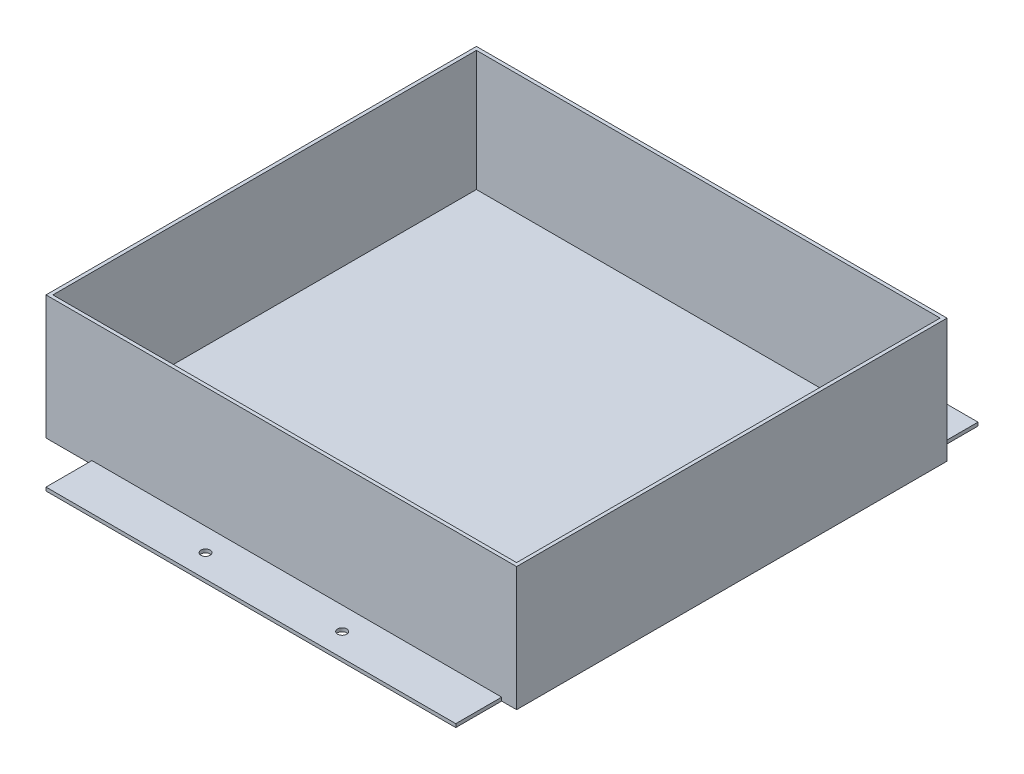
ISO-10303-21;
HEADER;
FILE_DESCRIPTION(('STEP AP214'),'2;1');
FILE_NAME('part.step','',(''),(''),'','','');
FILE_SCHEMA(('AUTOMOTIVE_DESIGN { 1 0 10303 214 1 1 1 1 }'));
ENDSEC;
DATA;
#1=APPLICATION_CONTEXT('core data for automotive mechanical design processes');
#2=APPLICATION_PROTOCOL_DEFINITION('international standard','automotive_design',2000,#1);
#3=PRODUCT_CONTEXT('',#1,'mechanical');
#4=PRODUCT('Part','Part','',(#3));
#5=PRODUCT_RELATED_PRODUCT_CATEGORY('part','',(#4));
#6=PRODUCT_DEFINITION_FORMATION('','',#4);
#7=PRODUCT_DEFINITION_CONTEXT('part definition',#1,'design');
#8=PRODUCT_DEFINITION('design','',#6,#7);
#9=PRODUCT_DEFINITION_SHAPE('','',#8);
#10=(LENGTH_UNIT() NAMED_UNIT(*) SI_UNIT(.MILLI.,.METRE.));
#11=(NAMED_UNIT(*) PLANE_ANGLE_UNIT() SI_UNIT($,.RADIAN.));
#12=(NAMED_UNIT(*) SI_UNIT($,.STERADIAN.) SOLID_ANGLE_UNIT());
#13=UNCERTAINTY_MEASURE_WITH_UNIT(LENGTH_MEASURE(1.E-05),#10,'distance_accuracy_value','');
#14=(GEOMETRIC_REPRESENTATION_CONTEXT(3) GLOBAL_UNCERTAINTY_ASSIGNED_CONTEXT((#13)) GLOBAL_UNIT_ASSIGNED_CONTEXT((#10,
#11,#12)) REPRESENTATION_CONTEXT('',''));
#15=CARTESIAN_POINT('',(0.,0.,0.));
#16=DIRECTION('',(0.,0.,1.));
#17=DIRECTION('',(1.,0.,0.));
#18=AXIS2_PLACEMENT_3D('',#15,#16,#17);
#19=CARTESIAN_POINT('',(0.,3.,0.));
#20=DIRECTION('',(0.,1.,0.));
#21=DIRECTION('',(0.,0.,1.));
#22=AXIS2_PLACEMENT_3D('',#19,#20,#21);
#23=PLANE('',#22);
#24=DIRECTION('',(-1.,0.,0.));
#25=VECTOR('',#24,1.);
#26=CARTESIAN_POINT('',(410.,3.,0.));
#27=LINE('',#26,#25);
#28=CARTESIAN_POINT('',(397.,3.,0.));
#29=VERTEX_POINT('',#28);
#30=CARTESIAN_POINT('',(40.,3.,0.));
#31=VERTEX_POINT('',#30);
#32=EDGE_CURVE('E11',#29,#31,#27,.T.);
#33=ORIENTED_EDGE('',*,*,#32,.F.);
#34=DIRECTION('',(0.,0.,-1.));
#35=VECTOR('',#34,1.);
#36=CARTESIAN_POINT('',(397.,3.,-40.));
#37=LINE('',#36,#35);
#38=CARTESIAN_POINT('',(397.,3.,-40.));
#39=VERTEX_POINT('',#38);
#40=EDGE_CURVE('E133',#29,#39,#37,.T.);
#41=ORIENTED_EDGE('',*,*,#40,.T.);
#42=DIRECTION('',(-1.,0.,0.));
#43=VECTOR('',#42,1.);
#44=CARTESIAN_POINT('',(40.,3.,-40.));
#45=LINE('',#44,#43);
#46=CARTESIAN_POINT('',(40.,3.,-40.));
#47=VERTEX_POINT('',#46);
#48=EDGE_CURVE('E137',#39,#47,#45,.T.);
#49=ORIENTED_EDGE('',*,*,#48,.T.);
#50=DIRECTION('',(0.,0.,1.));
#51=VECTOR('',#50,1.);
#52=CARTESIAN_POINT('',(40.,3.,0.));
#53=LINE('',#52,#51);
#54=EDGE_CURVE('E66',#47,#31,#53,.T.);
#55=ORIENTED_EDGE('',*,*,#54,.T.);
#56=EDGE_LOOP('',(#33,#41,#49,#55));
#57=FACE_BOUND('',#56,.T.);
#58=CARTESIAN_POINT('',(278.,3.,-20.));
#59=DIRECTION('',(0.,1.,0.));
#60=DIRECTION('',(0.,0.,1.));
#61=AXIS2_PLACEMENT_3D('',#58,#59,#60);
#62=CIRCLE('',#61,3.99999999999999);
#63=CARTESIAN_POINT('',(278.,3.,-16.));
#64=VERTEX_POINT('',#63);
#65=EDGE_CURVE('E264',#64,#64,#62,.T.);
#66=ORIENTED_EDGE('',*,*,#65,.F.);
#67=EDGE_LOOP('',(#66));
#68=FACE_BOUND('',#67,.T.);
#69=CARTESIAN_POINT('',(159.,3.,-20.));
#70=DIRECTION('',(0.,1.,0.));
#71=DIRECTION('',(0.,0.,1.));
#72=AXIS2_PLACEMENT_3D('',#69,#70,#71);
#73=CIRCLE('',#72,3.99999999999999);
#74=CARTESIAN_POINT('',(159.,3.,-16.));
#75=VERTEX_POINT('',#74);
#76=EDGE_CURVE('E169',#75,#75,#73,.T.);
#77=ORIENTED_EDGE('',*,*,#76,.F.);
#78=EDGE_LOOP('',(#77));
#79=FACE_BOUND('',#78,.T.);
#80=ADVANCED_FACE('F39',(#57,#68,#79),#23,.T.);
#81=DIRECTION('',(1.,0.,0.));
#82=VECTOR('',#81,1.);
#83=CARTESIAN_POINT('',(0.,3.,375.));
#84=LINE('',#83,#82);
#85=CARTESIAN_POINT('',(39.9999999999999,3.,375.));
#86=VERTEX_POINT('',#85);
#87=CARTESIAN_POINT('',(397.,3.,375.));
#88=VERTEX_POINT('',#87);
#89=EDGE_CURVE('E49',#86,#88,#84,.T.);
#90=ORIENTED_EDGE('',*,*,#89,.F.);
#91=DIRECTION('',(0.,0.,1.));
#92=VECTOR('',#91,1.);
#93=CARTESIAN_POINT('',(39.9999999999999,3.,375.));
#94=LINE('',#93,#92);
#95=CARTESIAN_POINT('',(39.9999999999999,3.,415.));
#96=VERTEX_POINT('',#95);
#97=EDGE_CURVE('E200',#86,#96,#94,.T.);
#98=ORIENTED_EDGE('',*,*,#97,.T.);
#99=DIRECTION('',(1.,0.,0.));
#100=VECTOR('',#99,1.);
#101=CARTESIAN_POINT('',(39.9999999999999,3.,415.));
#102=LINE('',#101,#100);
#103=CARTESIAN_POINT('',(397.,3.,415.));
#104=VERTEX_POINT('',#103);
#105=EDGE_CURVE('E280',#96,#104,#102,.T.);
#106=ORIENTED_EDGE('',*,*,#105,.T.);
#107=DIRECTION('',(0.,0.,-1.));
#108=VECTOR('',#107,1.);
#109=CARTESIAN_POINT('',(397.,3.,415.));
#110=LINE('',#109,#108);
#111=EDGE_CURVE('E143',#104,#88,#110,.T.);
#112=ORIENTED_EDGE('',*,*,#111,.T.);
#113=EDGE_LOOP('',(#90,#98,#106,#112));
#114=FACE_BOUND('',#113,.T.);
#115=CARTESIAN_POINT('',(278.,3.,395.));
#116=DIRECTION('',(0.,1.,0.));
#117=DIRECTION('',(0.,0.,-1.));
#118=AXIS2_PLACEMENT_3D('',#115,#116,#117);
#119=CIRCLE('',#118,3.99999999999999);
#120=CARTESIAN_POINT('',(278.,3.,391.));
#121=VERTEX_POINT('',#120);
#122=EDGE_CURVE('E256',#121,#121,#119,.T.);
#123=ORIENTED_EDGE('',*,*,#122,.F.);
#124=EDGE_LOOP('',(#123));
#125=FACE_BOUND('',#124,.T.);
#126=CARTESIAN_POINT('',(159.,3.,395.));
#127=DIRECTION('',(0.,1.,0.));
#128=DIRECTION('',(0.,0.,-1.));
#129=AXIS2_PLACEMENT_3D('',#126,#127,#128);
#130=CIRCLE('',#129,3.99999999999999);
#131=CARTESIAN_POINT('',(159.,3.,391.));
#132=VERTEX_POINT('',#131);
#133=EDGE_CURVE('E246',#132,#132,#130,.T.);
#134=ORIENTED_EDGE('',*,*,#133,.F.);
#135=EDGE_LOOP('',(#134));
#136=FACE_BOUND('',#135,.T.);
#137=ADVANCED_FACE('F285',(#114,#125,#136),#23,.T.);
#138=CARTESIAN_POINT('',(0.,0.,0.));
#139=DIRECTION('',(0.,1.,0.));
#140=DIRECTION('',(0.,0.,1.));
#141=AXIS2_PLACEMENT_3D('',#138,#139,#140);
#142=PLANE('',#141);
#143=DIRECTION('',(-1.,0.,0.));
#144=VECTOR('',#143,1.);
#145=CARTESIAN_POINT('',(40.,0.,0.));
#146=LINE('',#145,#144);
#147=CARTESIAN_POINT('',(40.,0.,0.));
#148=VERTEX_POINT('',#147);
#149=CARTESIAN_POINT('',(0.,0.,0.));
#150=VERTEX_POINT('',#149);
#151=EDGE_CURVE('E164',#148,#150,#146,.T.);
#152=ORIENTED_EDGE('',*,*,#151,.F.);
#153=DIRECTION('',(0.,0.,1.));
#154=VECTOR('',#153,1.);
#155=CARTESIAN_POINT('',(40.,0.,0.));
#156=LINE('',#155,#154);
#157=CARTESIAN_POINT('',(40.,0.,-40.));
#158=VERTEX_POINT('',#157);
#159=EDGE_CURVE('E111',#158,#148,#156,.T.);
#160=ORIENTED_EDGE('',*,*,#159,.F.);
#161=DIRECTION('',(-1.,0.,0.));
#162=VECTOR('',#161,1.);
#163=CARTESIAN_POINT('',(40.,0.,-40.));
#164=LINE('',#163,#162);
#165=CARTESIAN_POINT('',(397.,0.,-40.));
#166=VERTEX_POINT('',#165);
#167=EDGE_CURVE('E195',#166,#158,#164,.T.);
#168=ORIENTED_EDGE('',*,*,#167,.F.);
#169=DIRECTION('',(0.,0.,-1.));
#170=VECTOR('',#169,1.);
#171=CARTESIAN_POINT('',(397.,0.,-40.));
#172=LINE('',#171,#170);
#173=CARTESIAN_POINT('',(397.,0.,0.));
#174=VERTEX_POINT('',#173);
#175=EDGE_CURVE('E149',#174,#166,#172,.T.);
#176=ORIENTED_EDGE('',*,*,#175,.F.);
#177=DIRECTION('',(-1.,0.,0.));
#178=VECTOR('',#177,1.);
#179=CARTESIAN_POINT('',(410.,0.,0.));
#180=LINE('',#179,#178);
#181=CARTESIAN_POINT('',(410.,0.,0.));
#182=VERTEX_POINT('',#181);
#183=EDGE_CURVE('E190',#182,#174,#180,.T.);
#184=ORIENTED_EDGE('',*,*,#183,.F.);
#185=DIRECTION('',(0.,0.,-1.));
#186=VECTOR('',#185,1.);
#187=CARTESIAN_POINT('',(410.,0.,375.));
#188=LINE('',#187,#186);
#189=CARTESIAN_POINT('',(410.,0.,375.));
#190=VERTEX_POINT('',#189);
#191=EDGE_CURVE('E187',#190,#182,#188,.T.);
#192=ORIENTED_EDGE('',*,*,#191,.F.);
#193=DIRECTION('',(1.,0.,0.));
#194=VECTOR('',#193,1.);
#195=CARTESIAN_POINT('',(397.,0.,375.));
#196=LINE('',#195,#194);
#197=CARTESIAN_POINT('',(397.,0.,375.));
#198=VERTEX_POINT('',#197);
#199=EDGE_CURVE('E184',#198,#190,#196,.T.);
#200=ORIENTED_EDGE('',*,*,#199,.F.);
#201=DIRECTION('',(0.,0.,-1.));
#202=VECTOR('',#201,1.);
#203=CARTESIAN_POINT('',(397.,0.,415.));
#204=LINE('',#203,#202);
#205=CARTESIAN_POINT('',(397.,0.,415.));
#206=VERTEX_POINT('',#205);
#207=EDGE_CURVE('E181',#206,#198,#204,.T.);
#208=ORIENTED_EDGE('',*,*,#207,.F.);
#209=DIRECTION('',(1.,0.,0.));
#210=VECTOR('',#209,1.);
#211=CARTESIAN_POINT('',(39.9999999999999,0.,415.));
#212=LINE('',#211,#210);
#213=CARTESIAN_POINT('',(39.9999999999999,0.,415.));
#214=VERTEX_POINT('',#213);
#215=EDGE_CURVE('E178',#214,#206,#212,.T.);
#216=ORIENTED_EDGE('',*,*,#215,.F.);
#217=DIRECTION('',(0.,0.,1.));
#218=VECTOR('',#217,1.);
#219=CARTESIAN_POINT('',(39.9999999999999,0.,375.));
#220=LINE('',#219,#218);
#221=CARTESIAN_POINT('',(39.9999999999999,0.,375.));
#222=VERTEX_POINT('',#221);
#223=EDGE_CURVE('E175',#222,#214,#220,.T.);
#224=ORIENTED_EDGE('',*,*,#223,.F.);
#225=DIRECTION('',(1.,0.,0.));
#226=VECTOR('',#225,1.);
#227=CARTESIAN_POINT('',(0.,0.,375.));
#228=LINE('',#227,#226);
#229=CARTESIAN_POINT('',(0.,0.,375.));
#230=VERTEX_POINT('',#229);
#231=EDGE_CURVE('E172',#230,#222,#228,.T.);
#232=ORIENTED_EDGE('',*,*,#231,.F.);
#233=DIRECTION('',(0.,0.,1.));
#234=VECTOR('',#233,1.);
#235=CARTESIAN_POINT('',(0.,0.,0.));
#236=LINE('',#235,#234);
#237=EDGE_CURVE('E168',#150,#230,#236,.T.);
#238=ORIENTED_EDGE('',*,*,#237,.F.);
#239=EDGE_LOOP('',(#152,#160,#168,#176,#184,#192,#200,#208,#216,#224,#232,#238));
#240=FACE_BOUND('',#239,.T.);
#241=CARTESIAN_POINT('',(159.,0.,-20.));
#242=DIRECTION('',(0.,1.,0.));
#243=DIRECTION('',(0.,0.,1.));
#244=AXIS2_PLACEMENT_3D('',#241,#242,#243);
#245=CIRCLE('',#244,3.99999999999999);
#246=CARTESIAN_POINT('',(159.,0.,-16.));
#247=VERTEX_POINT('',#246);
#248=EDGE_CURVE('E268',#247,#247,#245,.T.);
#249=ORIENTED_EDGE('',*,*,#248,.T.);
#250=EDGE_LOOP('',(#249));
#251=FACE_BOUND('',#250,.T.);
#252=CARTESIAN_POINT('',(278.,0.,-20.));
#253=DIRECTION('',(0.,1.,0.));
#254=DIRECTION('',(0.,0.,1.));
#255=AXIS2_PLACEMENT_3D('',#252,#253,#254);
#256=CIRCLE('',#255,3.99999999999999);
#257=CARTESIAN_POINT('',(278.,0.,-16.));
#258=VERTEX_POINT('',#257);
#259=EDGE_CURVE('E260',#258,#258,#256,.T.);
#260=ORIENTED_EDGE('',*,*,#259,.T.);
#261=EDGE_LOOP('',(#260));
#262=FACE_BOUND('',#261,.T.);
#263=CARTESIAN_POINT('',(278.,0.,395.));
#264=DIRECTION('',(0.,1.,0.));
#265=DIRECTION('',(0.,0.,-1.));
#266=AXIS2_PLACEMENT_3D('',#263,#264,#265);
#267=CIRCLE('',#266,3.99999999999999);
#268=CARTESIAN_POINT('',(278.,0.,391.));
#269=VERTEX_POINT('',#268);
#270=EDGE_CURVE('E250',#269,#269,#267,.T.);
#271=ORIENTED_EDGE('',*,*,#270,.T.);
#272=EDGE_LOOP('',(#271));
#273=FACE_BOUND('',#272,.T.);
#274=CARTESIAN_POINT('',(159.,0.,395.));
#275=DIRECTION('',(0.,1.,0.));
#276=DIRECTION('',(0.,0.,-1.));
#277=AXIS2_PLACEMENT_3D('',#274,#275,#276);
#278=CIRCLE('',#277,3.99999999999999);
#279=CARTESIAN_POINT('',(159.,0.,391.));
#280=VERTEX_POINT('',#279);
#281=EDGE_CURVE('E251',#280,#280,#278,.T.);
#282=ORIENTED_EDGE('',*,*,#281,.T.);
#283=EDGE_LOOP('',(#282));
#284=FACE_BOUND('',#283,.T.);
#285=ADVANCED_FACE('F298',(#240,#251,#262,#273,#284),#142,.F.);
#286=CARTESIAN_POINT('',(0.,3.,0.));
#287=DIRECTION('',(1.,0.,0.));
#288=DIRECTION('',(0.,0.,-1.));
#289=AXIS2_PLACEMENT_3D('',#286,#287,#288);
#290=PLANE('',#289);
#291=ORIENTED_EDGE('',*,*,#237,.T.);
#292=DIRECTION('',(0.,-1.,0.));
#293=VECTOR('',#292,1.);
#294=CARTESIAN_POINT('',(0.,3.,375.));
#295=LINE('',#294,#293);
#296=CARTESIAN_POINT('',(0.,108.,375.));
#297=VERTEX_POINT('',#296);
#298=EDGE_CURVE('E230',#297,#230,#295,.T.);
#299=ORIENTED_EDGE('',*,*,#298,.F.);
#300=DIRECTION('',(0.,0.,1.));
#301=VECTOR('',#300,1.);
#302=CARTESIAN_POINT('',(0.,108.,0.));
#303=LINE('',#302,#301);
#304=CARTESIAN_POINT('',(0.,108.,0.));
#305=VERTEX_POINT('',#304);
#306=EDGE_CURVE('E318',#305,#297,#303,.T.);
#307=ORIENTED_EDGE('',*,*,#306,.F.);
#308=DIRECTION('',(0.,-1.,0.));
#309=VECTOR('',#308,1.);
#310=CARTESIAN_POINT('',(0.,3.,0.));
#311=LINE('',#310,#309);
#312=EDGE_CURVE('E43',#305,#150,#311,.T.);
#313=ORIENTED_EDGE('',*,*,#312,.T.);
#314=EDGE_LOOP('',(#291,#299,#307,#313));
#315=FACE_BOUND('',#314,.T.);
#316=ADVANCED_FACE('F41',(#315),#290,.F.);
#317=CARTESIAN_POINT('',(39.9999999999999,3.,375.));
#318=DIRECTION('',(1.,0.,0.));
#319=DIRECTION('',(0.,0.,-1.));
#320=AXIS2_PLACEMENT_3D('',#317,#318,#319);
#321=PLANE('',#320);
#322=ORIENTED_EDGE('',*,*,#223,.T.);
#323=DIRECTION('',(0.,-1.,0.));
#324=VECTOR('',#323,1.);
#325=CARTESIAN_POINT('',(39.9999999999999,3.,415.));
#326=LINE('',#325,#324);
#327=EDGE_CURVE('E223',#96,#214,#326,.T.);
#328=ORIENTED_EDGE('',*,*,#327,.F.);
#329=ORIENTED_EDGE('',*,*,#97,.F.);
#330=DIRECTION('',(0.,-1.,0.));
#331=VECTOR('',#330,1.);
#332=CARTESIAN_POINT('',(39.9999999999999,3.,375.));
#333=LINE('',#332,#331);
#334=EDGE_CURVE('E227',#86,#222,#333,.T.);
#335=ORIENTED_EDGE('',*,*,#334,.T.);
#336=EDGE_LOOP('',(#322,#328,#329,#335));
#337=FACE_BOUND('',#336,.T.);
#338=ADVANCED_FACE('F443',(#337),#321,.F.);
#339=CARTESIAN_POINT('',(39.9999999999999,3.,415.));
#340=DIRECTION('',(0.,0.,-1.));
#341=DIRECTION('',(-1.,0.,0.));
#342=AXIS2_PLACEMENT_3D('',#339,#340,#341);
#343=PLANE('',#342);
#344=ORIENTED_EDGE('',*,*,#215,.T.);
#345=DIRECTION('',(0.,-1.,0.));
#346=VECTOR('',#345,1.);
#347=CARTESIAN_POINT('',(397.,3.,415.));
#348=LINE('',#347,#346);
#349=EDGE_CURVE('E219',#104,#206,#348,.T.);
#350=ORIENTED_EDGE('',*,*,#349,.F.);
#351=ORIENTED_EDGE('',*,*,#105,.F.);
#352=ORIENTED_EDGE('',*,*,#327,.T.);
#353=EDGE_LOOP('',(#344,#350,#351,#352));
#354=FACE_BOUND('',#353,.T.);
#355=ADVANCED_FACE('F441',(#354),#343,.F.);
#356=CARTESIAN_POINT('',(397.,3.,415.));
#357=DIRECTION('',(-1.,0.,0.));
#358=DIRECTION('',(0.,0.,1.));
#359=AXIS2_PLACEMENT_3D('',#356,#357,#358);
#360=PLANE('',#359);
#361=ORIENTED_EDGE('',*,*,#207,.T.);
#362=DIRECTION('',(0.,-1.,0.));
#363=VECTOR('',#362,1.);
#364=CARTESIAN_POINT('',(397.,3.,375.));
#365=LINE('',#364,#363);
#366=EDGE_CURVE('E215',#88,#198,#365,.T.);
#367=ORIENTED_EDGE('',*,*,#366,.F.);
#368=ORIENTED_EDGE('',*,*,#111,.F.);
#369=ORIENTED_EDGE('',*,*,#349,.T.);
#370=EDGE_LOOP('',(#361,#367,#368,#369));
#371=FACE_BOUND('',#370,.T.);
#372=ADVANCED_FACE('F290',(#371),#360,.F.);
#373=CARTESIAN_POINT('',(397.,3.,375.));
#374=DIRECTION('',(0.,0.,-1.));
#375=DIRECTION('',(-1.,0.,0.));
#376=AXIS2_PLACEMENT_3D('',#373,#374,#375);
#377=PLANE('',#376);
#378=ORIENTED_EDGE('',*,*,#199,.T.);
#379=DIRECTION('',(0.,-1.,0.));
#380=VECTOR('',#379,1.);
#381=CARTESIAN_POINT('',(410.,3.,375.));
#382=LINE('',#381,#380);
#383=CARTESIAN_POINT('',(410.,108.,375.));
#384=VERTEX_POINT('',#383);
#385=EDGE_CURVE('E211',#384,#190,#382,.T.);
#386=ORIENTED_EDGE('',*,*,#385,.F.);
#387=DIRECTION('',(1.,0.,0.));
#388=VECTOR('',#387,1.);
#389=CARTESIAN_POINT('',(0.,108.,375.));
#390=LINE('',#389,#388);
#391=EDGE_CURVE('E323',#297,#384,#390,.T.);
#392=ORIENTED_EDGE('',*,*,#391,.F.);
#393=ORIENTED_EDGE('',*,*,#298,.T.);
#394=ORIENTED_EDGE('',*,*,#231,.T.);
#395=ORIENTED_EDGE('',*,*,#334,.F.);
#396=ORIENTED_EDGE('',*,*,#89,.T.);
#397=ORIENTED_EDGE('',*,*,#366,.T.);
#398=EDGE_LOOP('',(#378,#386,#392,#393,#394,#395,#396,#397));
#399=FACE_BOUND('',#398,.T.);
#400=ADVANCED_FACE('F293',(#399),#377,.F.);
#401=CARTESIAN_POINT('',(410.,3.,375.));
#402=DIRECTION('',(-1.,0.,0.));
#403=DIRECTION('',(0.,0.,1.));
#404=AXIS2_PLACEMENT_3D('',#401,#402,#403);
#405=PLANE('',#404);
#406=ORIENTED_EDGE('',*,*,#191,.T.);
#407=DIRECTION('',(0.,-1.,0.));
#408=VECTOR('',#407,1.);
#409=CARTESIAN_POINT('',(410.,3.,0.));
#410=LINE('',#409,#408);
#411=CARTESIAN_POINT('',(410.,108.,0.));
#412=VERTEX_POINT('',#411);
#413=EDGE_CURVE('E207',#412,#182,#410,.T.);
#414=ORIENTED_EDGE('',*,*,#413,.F.);
#415=DIRECTION('',(0.,0.,-1.));
#416=VECTOR('',#415,1.);
#417=CARTESIAN_POINT('',(410.,108.,375.));
#418=LINE('',#417,#416);
#419=EDGE_CURVE('E255',#384,#412,#418,.T.);
#420=ORIENTED_EDGE('',*,*,#419,.F.);
#421=ORIENTED_EDGE('',*,*,#385,.T.);
#422=EDGE_LOOP('',(#406,#414,#420,#421));
#423=FACE_BOUND('',#422,.T.);
#424=ADVANCED_FACE('F304',(#423),#405,.F.);
#425=CARTESIAN_POINT('',(410.,3.,0.));
#426=DIRECTION('',(0.,0.,1.));
#427=DIRECTION('',(1.,0.,0.));
#428=AXIS2_PLACEMENT_3D('',#425,#426,#427);
#429=PLANE('',#428);
#430=ORIENTED_EDGE('',*,*,#183,.T.);
#431=DIRECTION('',(0.,-1.,0.));
#432=VECTOR('',#431,1.);
#433=CARTESIAN_POINT('',(397.,3.,0.));
#434=LINE('',#433,#432);
#435=EDGE_CURVE('E153',#29,#174,#434,.T.);
#436=ORIENTED_EDGE('',*,*,#435,.F.);
#437=ORIENTED_EDGE('',*,*,#32,.T.);
#438=DIRECTION('',(0.,-1.,0.));
#439=VECTOR('',#438,1.);
#440=CARTESIAN_POINT('',(40.,3.,0.));
#441=LINE('',#440,#439);
#442=EDGE_CURVE('E160',#31,#148,#441,.T.);
#443=ORIENTED_EDGE('',*,*,#442,.T.);
#444=ORIENTED_EDGE('',*,*,#151,.T.);
#445=ORIENTED_EDGE('',*,*,#312,.F.);
#446=DIRECTION('',(-1.,0.,0.));
#447=VECTOR('',#446,1.);
#448=CARTESIAN_POINT('',(410.,108.,0.));
#449=LINE('',#448,#447);
#450=EDGE_CURVE('E312',#412,#305,#449,.T.);
#451=ORIENTED_EDGE('',*,*,#450,.F.);
#452=ORIENTED_EDGE('',*,*,#413,.T.);
#453=EDGE_LOOP('',(#430,#436,#437,#443,#444,#445,#451,#452));
#454=FACE_BOUND('',#453,.T.);
#455=ADVANCED_FACE('F310',(#454),#429,.F.);
#456=CARTESIAN_POINT('',(397.,3.,-40.));
#457=DIRECTION('',(-1.,0.,0.));
#458=DIRECTION('',(0.,0.,1.));
#459=AXIS2_PLACEMENT_3D('',#456,#457,#458);
#460=PLANE('',#459);
#461=ORIENTED_EDGE('',*,*,#175,.T.);
#462=DIRECTION('',(0.,-1.,0.));
#463=VECTOR('',#462,1.);
#464=CARTESIAN_POINT('',(397.,3.,-40.));
#465=LINE('',#464,#463);
#466=EDGE_CURVE('E146',#39,#166,#465,.T.);
#467=ORIENTED_EDGE('',*,*,#466,.F.);
#468=ORIENTED_EDGE('',*,*,#40,.F.);
#469=ORIENTED_EDGE('',*,*,#435,.T.);
#470=EDGE_LOOP('',(#461,#467,#468,#469));
#471=FACE_BOUND('',#470,.T.);
#472=ADVANCED_FACE('F147',(#471),#460,.F.);
#473=CARTESIAN_POINT('',(40.,3.,-40.));
#474=DIRECTION('',(0.,0.,1.));
#475=DIRECTION('',(1.,0.,0.));
#476=AXIS2_PLACEMENT_3D('',#473,#474,#475);
#477=PLANE('',#476);
#478=ORIENTED_EDGE('',*,*,#167,.T.);
#479=DIRECTION('',(0.,-1.,0.));
#480=VECTOR('',#479,1.);
#481=CARTESIAN_POINT('',(40.,3.,-40.));
#482=LINE('',#481,#480);
#483=EDGE_CURVE('E154',#47,#158,#482,.T.);
#484=ORIENTED_EDGE('',*,*,#483,.F.);
#485=ORIENTED_EDGE('',*,*,#48,.F.);
#486=ORIENTED_EDGE('',*,*,#466,.T.);
#487=EDGE_LOOP('',(#478,#484,#485,#486));
#488=FACE_BOUND('',#487,.T.);
#489=ADVANCED_FACE('F156',(#488),#477,.F.);
#490=CARTESIAN_POINT('',(40.,3.,0.));
#491=DIRECTION('',(1.,0.,0.));
#492=DIRECTION('',(0.,0.,-1.));
#493=AXIS2_PLACEMENT_3D('',#490,#491,#492);
#494=PLANE('',#493);
#495=ORIENTED_EDGE('',*,*,#159,.T.);
#496=ORIENTED_EDGE('',*,*,#442,.F.);
#497=ORIENTED_EDGE('',*,*,#54,.F.);
#498=ORIENTED_EDGE('',*,*,#483,.T.);
#499=EDGE_LOOP('',(#495,#496,#497,#498));
#500=FACE_BOUND('',#499,.T.);
#501=ADVANCED_FACE('F426',(#500),#494,.F.);
#502=CARTESIAN_POINT('',(159.,3.,-20.));
#503=DIRECTION('',(0.,-1.,0.));
#504=DIRECTION('',(0.,0.,-1.));
#505=AXIS2_PLACEMENT_3D('',#502,#503,#504);
#506=CYLINDRICAL_SURFACE('',#505,3.99999999999999);
#507=ORIENTED_EDGE('',*,*,#76,.T.);
#508=EDGE_LOOP('',(#507));
#509=FACE_BOUND('',#508,.T.);
#510=ORIENTED_EDGE('',*,*,#248,.F.);
#511=EDGE_LOOP('',(#510));
#512=FACE_BOUND('',#511,.T.);
#513=ADVANCED_FACE('F422',(#509,#512),#506,.F.);
#514=CARTESIAN_POINT('',(278.,3.,-20.));
#515=DIRECTION('',(0.,-1.,0.));
#516=DIRECTION('',(0.,0.,-1.));
#517=AXIS2_PLACEMENT_3D('',#514,#515,#516);
#518=CYLINDRICAL_SURFACE('',#517,3.99999999999999);
#519=ORIENTED_EDGE('',*,*,#65,.T.);
#520=EDGE_LOOP('',(#519));
#521=FACE_BOUND('',#520,.T.);
#522=ORIENTED_EDGE('',*,*,#259,.F.);
#523=EDGE_LOOP('',(#522));
#524=FACE_BOUND('',#523,.T.);
#525=ADVANCED_FACE('F491',(#521,#524),#518,.F.);
#526=CARTESIAN_POINT('',(278.,3.,395.));
#527=DIRECTION('',(0.,-1.,0.));
#528=DIRECTION('',(0.,0.,-1.));
#529=AXIS2_PLACEMENT_3D('',#526,#527,#528);
#530=CYLINDRICAL_SURFACE('',#529,3.99999999999999);
#531=ORIENTED_EDGE('',*,*,#122,.T.);
#532=EDGE_LOOP('',(#531));
#533=FACE_BOUND('',#532,.T.);
#534=ORIENTED_EDGE('',*,*,#270,.F.);
#535=EDGE_LOOP('',(#534));
#536=FACE_BOUND('',#535,.T.);
#537=ADVANCED_FACE('F480',(#533,#536),#530,.F.);
#538=CARTESIAN_POINT('',(159.,3.,395.));
#539=DIRECTION('',(0.,-1.,0.));
#540=DIRECTION('',(0.,0.,-1.));
#541=AXIS2_PLACEMENT_3D('',#538,#539,#540);
#542=CYLINDRICAL_SURFACE('',#541,3.99999999999999);
#543=ORIENTED_EDGE('',*,*,#133,.T.);
#544=EDGE_LOOP('',(#543));
#545=FACE_BOUND('',#544,.T.);
#546=ORIENTED_EDGE('',*,*,#281,.F.);
#547=EDGE_LOOP('',(#546));
#548=FACE_BOUND('',#547,.T.);
#549=ADVANCED_FACE('F475',(#545,#548),#542,.F.);
#550=CARTESIAN_POINT('',(0.,108.,0.));
#551=DIRECTION('',(0.,1.,0.));
#552=DIRECTION('',(0.,0.,1.));
#553=AXIS2_PLACEMENT_3D('',#550,#551,#552);
#554=PLANE('',#553);
#555=ORIENTED_EDGE('',*,*,#450,.T.);
#556=ORIENTED_EDGE('',*,*,#306,.T.);
#557=ORIENTED_EDGE('',*,*,#391,.T.);
#558=ORIENTED_EDGE('',*,*,#419,.T.);
#559=EDGE_LOOP('',(#555,#556,#557,#558));
#560=FACE_BOUND('',#559,.T.);
#561=DIRECTION('',(-1.,0.,0.));
#562=VECTOR('',#561,1.);
#563=CARTESIAN_POINT('',(407.,108.,3.00000000000001));
#564=LINE('',#563,#562);
#565=CARTESIAN_POINT('',(407.,108.,3.00000000000001));
#566=VERTEX_POINT('',#565);
#567=CARTESIAN_POINT('',(3.,108.,3.00000000000001));
#568=VERTEX_POINT('',#567);
#569=EDGE_CURVE('E365',#566,#568,#564,.T.);
#570=ORIENTED_EDGE('',*,*,#569,.F.);
#571=DIRECTION('',(0.,0.,-1.));
#572=VECTOR('',#571,1.);
#573=CARTESIAN_POINT('',(407.,108.,372.));
#574=LINE('',#573,#572);
#575=CARTESIAN_POINT('',(407.,108.,372.));
#576=VERTEX_POINT('',#575);
#577=EDGE_CURVE('E358',#576,#566,#574,.T.);
#578=ORIENTED_EDGE('',*,*,#577,.F.);
#579=DIRECTION('',(1.,0.,0.));
#580=VECTOR('',#579,1.);
#581=CARTESIAN_POINT('',(3.,108.,372.));
#582=LINE('',#581,#580);
#583=CARTESIAN_POINT('',(3.,108.,372.));
#584=VERTEX_POINT('',#583);
#585=EDGE_CURVE('E379',#584,#576,#582,.T.);
#586=ORIENTED_EDGE('',*,*,#585,.F.);
#587=DIRECTION('',(0.,0.,1.));
#588=VECTOR('',#587,1.);
#589=CARTESIAN_POINT('',(3.,108.,3.00000000000001));
#590=LINE('',#589,#588);
#591=EDGE_CURVE('E375',#568,#584,#590,.T.);
#592=ORIENTED_EDGE('',*,*,#591,.F.);
#593=EDGE_LOOP('',(#570,#578,#586,#592));
#594=FACE_BOUND('',#593,.T.);
#595=ADVANCED_FACE('F333',(#560,#594),#554,.T.);
#596=CARTESIAN_POINT('',(407.,108.,372.));
#597=DIRECTION('',(-1.,0.,0.));
#598=DIRECTION('',(0.,0.,1.));
#599=AXIS2_PLACEMENT_3D('',#596,#597,#598);
#600=PLANE('',#599);
#601=DIRECTION('',(0.,0.,-1.));
#602=VECTOR('',#601,1.);
#603=CARTESIAN_POINT('',(407.,3.,372.));
#604=LINE('',#603,#602);
#605=CARTESIAN_POINT('',(407.,3.,372.));
#606=VERTEX_POINT('',#605);
#607=CARTESIAN_POINT('',(407.,3.,3.00000000000001));
#608=VERTEX_POINT('',#607);
#609=EDGE_CURVE('E384',#606,#608,#604,.T.);
#610=ORIENTED_EDGE('',*,*,#609,.F.);
#611=DIRECTION('',(0.,-1.,0.));
#612=VECTOR('',#611,1.);
#613=CARTESIAN_POINT('',(407.,108.,372.));
#614=LINE('',#613,#612);
#615=EDGE_CURVE('E57',#576,#606,#614,.T.);
#616=ORIENTED_EDGE('',*,*,#615,.F.);
#617=ORIENTED_EDGE('',*,*,#577,.T.);
#618=DIRECTION('',(0.,-1.,0.));
#619=VECTOR('',#618,1.);
#620=CARTESIAN_POINT('',(407.,108.,3.00000000000001));
#621=LINE('',#620,#619);
#622=EDGE_CURVE('E319',#566,#608,#621,.T.);
#623=ORIENTED_EDGE('',*,*,#622,.T.);
#624=EDGE_LOOP('',(#610,#616,#617,#623));
#625=FACE_BOUND('',#624,.T.);
#626=ADVANCED_FACE('F360',(#625),#600,.T.);
#627=CARTESIAN_POINT('',(407.,108.,3.00000000000001));
#628=DIRECTION('',(0.,0.,1.));
#629=DIRECTION('',(1.,0.,0.));
#630=AXIS2_PLACEMENT_3D('',#627,#628,#629);
#631=PLANE('',#630);
#632=DIRECTION('',(-1.,0.,0.));
#633=VECTOR('',#632,1.);
#634=CARTESIAN_POINT('',(407.,3.,3.00000000000001));
#635=LINE('',#634,#633);
#636=CARTESIAN_POINT('',(3.,3.,3.00000000000001));
#637=VERTEX_POINT('',#636);
#638=EDGE_CURVE('E372',#608,#637,#635,.T.);
#639=ORIENTED_EDGE('',*,*,#638,.F.);
#640=ORIENTED_EDGE('',*,*,#622,.F.);
#641=ORIENTED_EDGE('',*,*,#569,.T.);
#642=DIRECTION('',(0.,-1.,0.));
#643=VECTOR('',#642,1.);
#644=CARTESIAN_POINT('',(3.,108.,3.00000000000001));
#645=LINE('',#644,#643);
#646=EDGE_CURVE('E326',#568,#637,#645,.T.);
#647=ORIENTED_EDGE('',*,*,#646,.T.);
#648=EDGE_LOOP('',(#639,#640,#641,#647));
#649=FACE_BOUND('',#648,.T.);
#650=ADVANCED_FACE('F369',(#649),#631,.T.);
#651=CARTESIAN_POINT('',(3.,108.,3.00000000000001));
#652=DIRECTION('',(1.,0.,0.));
#653=DIRECTION('',(0.,0.,-1.));
#654=AXIS2_PLACEMENT_3D('',#651,#652,#653);
#655=PLANE('',#654);
#656=DIRECTION('',(0.,0.,1.));
#657=VECTOR('',#656,1.);
#658=CARTESIAN_POINT('',(3.,3.,3.00000000000001));
#659=LINE('',#658,#657);
#660=CARTESIAN_POINT('',(3.,3.,372.));
#661=VERTEX_POINT('',#660);
#662=EDGE_CURVE('E389',#637,#661,#659,.T.);
#663=ORIENTED_EDGE('',*,*,#662,.F.);
#664=ORIENTED_EDGE('',*,*,#646,.F.);
#665=ORIENTED_EDGE('',*,*,#591,.T.);
#666=DIRECTION('',(0.,-1.,0.));
#667=VECTOR('',#666,1.);
#668=CARTESIAN_POINT('',(3.,108.,372.));
#669=LINE('',#668,#667);
#670=EDGE_CURVE('E398',#584,#661,#669,.T.);
#671=ORIENTED_EDGE('',*,*,#670,.T.);
#672=EDGE_LOOP('',(#663,#664,#665,#671));
#673=FACE_BOUND('',#672,.T.);
#674=ADVANCED_FACE('F403',(#673),#655,.T.);
#675=CARTESIAN_POINT('',(3.,108.,372.));
#676=DIRECTION('',(0.,0.,-1.));
#677=DIRECTION('',(-1.,0.,0.));
#678=AXIS2_PLACEMENT_3D('',#675,#676,#677);
#679=PLANE('',#678);
#680=DIRECTION('',(1.,0.,0.));
#681=VECTOR('',#680,1.);
#682=CARTESIAN_POINT('',(3.,3.,372.));
#683=LINE('',#682,#681);
#684=EDGE_CURVE('E366',#661,#606,#683,.T.);
#685=ORIENTED_EDGE('',*,*,#684,.F.);
#686=ORIENTED_EDGE('',*,*,#670,.F.);
#687=ORIENTED_EDGE('',*,*,#585,.T.);
#688=ORIENTED_EDGE('',*,*,#615,.T.);
#689=EDGE_LOOP('',(#685,#686,#687,#688));
#690=FACE_BOUND('',#689,.T.);
#691=ADVANCED_FACE('F407',(#690),#679,.T.);
#692=ORIENTED_EDGE('',*,*,#684,.T.);
#693=ORIENTED_EDGE('',*,*,#609,.T.);
#694=ORIENTED_EDGE('',*,*,#638,.T.);
#695=ORIENTED_EDGE('',*,*,#662,.T.);
#696=EDGE_LOOP('',(#692,#693,#694,#695));
#697=FACE_BOUND('',#696,.T.);
#698=ADVANCED_FACE('F406',(#697),#23,.T.);
#699=CLOSED_SHELL('',(#80,#137,#285,#316,#338,#355,#372,#400,#424,#455,#472,#489,#501,#513,#525,
#537,#549,#595,#626,#650,#674,#691,#698));
#700=MANIFOLD_SOLID_BREP('B2',#699);
#701=ADVANCED_BREP_SHAPE_REPRESENTATION('',(#18,#700),#14);
#702=SHAPE_DEFINITION_REPRESENTATION(#9,#701);
ENDSEC;
END-ISO-10303-21;
